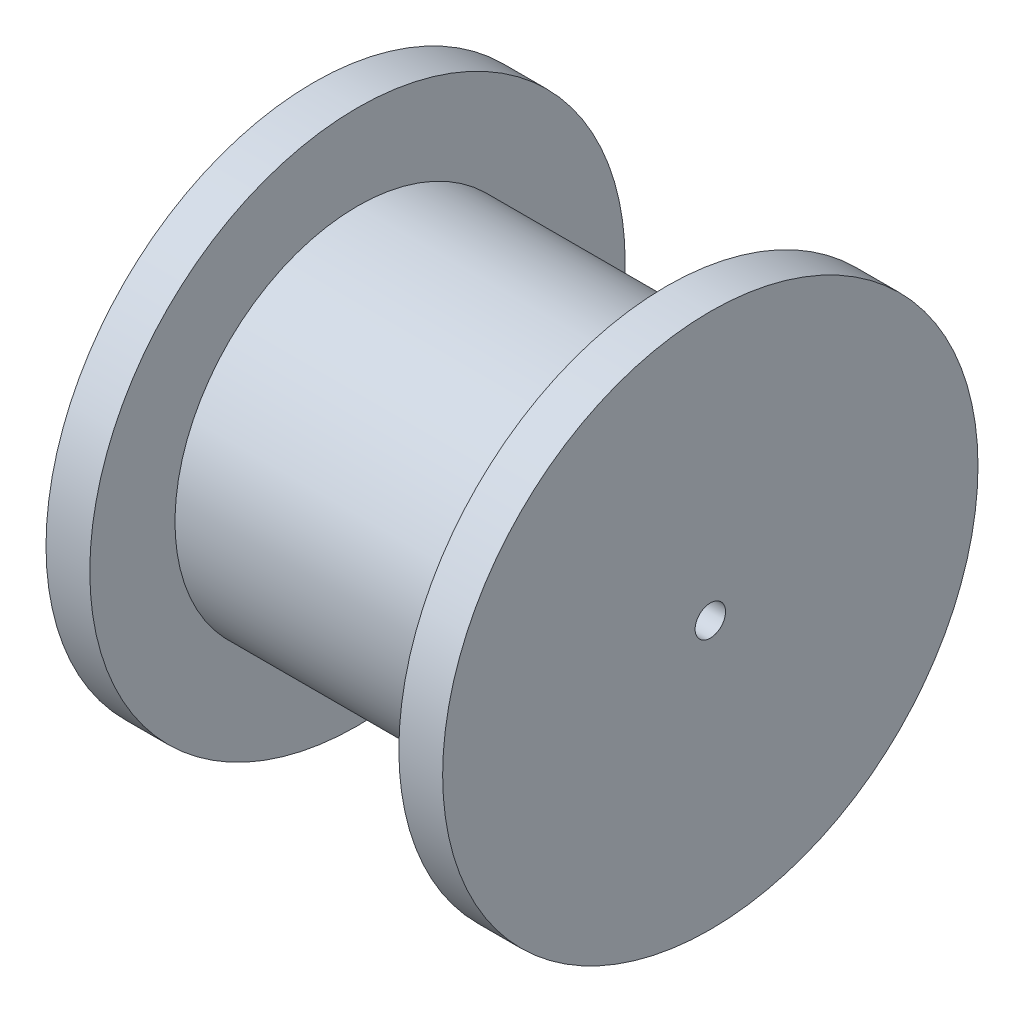
ISO-10303-21;
HEADER;
FILE_DESCRIPTION(('STEP AP214'),'2;1');
FILE_NAME('part.step','',(''),(''),'','','');
FILE_SCHEMA(('AUTOMOTIVE_DESIGN { 1 0 10303 214 1 1 1 1 }'));
ENDSEC;
DATA;
#1=APPLICATION_CONTEXT('core data for automotive mechanical design processes');
#2=APPLICATION_PROTOCOL_DEFINITION('international standard','automotive_design',2000,#1);
#3=PRODUCT_CONTEXT('',#1,'mechanical');
#4=PRODUCT('Part','Part','',(#3));
#5=PRODUCT_RELATED_PRODUCT_CATEGORY('part','',(#4));
#6=PRODUCT_DEFINITION_FORMATION('','',#4);
#7=PRODUCT_DEFINITION_CONTEXT('part definition',#1,'design');
#8=PRODUCT_DEFINITION('design','',#6,#7);
#9=PRODUCT_DEFINITION_SHAPE('','',#8);
#10=(LENGTH_UNIT() NAMED_UNIT(*) SI_UNIT(.MILLI.,.METRE.));
#11=(NAMED_UNIT(*) PLANE_ANGLE_UNIT() SI_UNIT($,.RADIAN.));
#12=(NAMED_UNIT(*) SI_UNIT($,.STERADIAN.) SOLID_ANGLE_UNIT());
#13=UNCERTAINTY_MEASURE_WITH_UNIT(LENGTH_MEASURE(1.E-05),#10,'distance_accuracy_value','');
#14=(GEOMETRIC_REPRESENTATION_CONTEXT(3) GLOBAL_UNCERTAINTY_ASSIGNED_CONTEXT((#13)) GLOBAL_UNIT_ASSIGNED_CONTEXT((#10,
#11,#12)) REPRESENTATION_CONTEXT('',''));
#15=CARTESIAN_POINT('',(0.,0.,0.));
#16=DIRECTION('',(0.,0.,1.));
#17=DIRECTION('',(1.,0.,0.));
#18=AXIS2_PLACEMENT_3D('',#15,#16,#17);
#19=CARTESIAN_POINT('',(-32.6,0.,0.));
#20=DIRECTION('',(1.,0.,0.));
#21=DIRECTION('',(0.,1.,0.));
#22=AXIS2_PLACEMENT_3D('',#19,#20,#21);
#23=PLANE('',#22);
#24=CARTESIAN_POINT('',(-32.6,0.,0.));
#25=DIRECTION('',(-1.,0.,0.));
#26=DIRECTION('',(0.,-1.,0.));
#27=AXIS2_PLACEMENT_3D('',#24,#25,#26);
#28=CIRCLE('',#27,1.25);
#29=CARTESIAN_POINT('',(-32.6,-1.25000000000001,0.));
#30=VERTEX_POINT('',#29);
#31=EDGE_CURVE('E71',#30,#30,#28,.T.);
#32=ORIENTED_EDGE('',*,*,#31,.F.);
#33=EDGE_LOOP('',(#32));
#34=FACE_BOUND('',#33,.T.);
#35=CARTESIAN_POINT('',(-32.6,0.,0.));
#36=DIRECTION('',(1.,0.,0.));
#37=DIRECTION('',(0.,1.,0.));
#38=AXIS2_PLACEMENT_3D('',#35,#36,#37);
#39=CIRCLE('',#38,22.);
#40=CARTESIAN_POINT('',(-32.6,22.,0.));
#41=VERTEX_POINT('',#40);
#42=EDGE_CURVE('E66',#41,#41,#39,.T.);
#43=ORIENTED_EDGE('',*,*,#42,.F.);
#44=EDGE_LOOP('',(#43));
#45=FACE_BOUND('',#44,.T.);
#46=ADVANCED_FACE('F39',(#34,#45),#23,.F.);
#47=CARTESIAN_POINT('',(0.,0.,0.));
#48=DIRECTION('',(1.,0.,0.));
#49=DIRECTION('',(0.,1.,0.));
#50=AXIS2_PLACEMENT_3D('',#47,#48,#49);
#51=PLANE('',#50);
#52=CARTESIAN_POINT('',(0.,0.,0.));
#53=DIRECTION('',(-1.,0.,0.));
#54=DIRECTION('',(0.,-1.,0.));
#55=AXIS2_PLACEMENT_3D('',#52,#53,#54);
#56=CIRCLE('',#55,1.25);
#57=CARTESIAN_POINT('',(0.,-1.25,0.));
#58=VERTEX_POINT('',#57);
#59=EDGE_CURVE('E70',#58,#58,#56,.T.);
#60=ORIENTED_EDGE('',*,*,#59,.T.);
#61=EDGE_LOOP('',(#60));
#62=FACE_BOUND('',#61,.T.);
#63=CARTESIAN_POINT('',(0.,0.,0.));
#64=DIRECTION('',(1.,0.,0.));
#65=DIRECTION('',(0.,1.,0.));
#66=AXIS2_PLACEMENT_3D('',#63,#64,#65);
#67=CIRCLE('',#66,22.);
#68=CARTESIAN_POINT('',(0.,22.,0.));
#69=VERTEX_POINT('',#68);
#70=EDGE_CURVE('E10',#69,#69,#67,.T.);
#71=ORIENTED_EDGE('',*,*,#70,.T.);
#72=EDGE_LOOP('',(#71));
#73=FACE_BOUND('',#72,.T.);
#74=ADVANCED_FACE('F79',(#62,#73),#51,.T.);
#75=CARTESIAN_POINT('',(0.,0.,0.));
#76=DIRECTION('',(1.,0.,0.));
#77=DIRECTION('',(0.,1.,0.));
#78=AXIS2_PLACEMENT_3D('',#75,#76,#77);
#79=CYLINDRICAL_SURFACE('',#78,22.);
#80=ORIENTED_EDGE('',*,*,#70,.F.);
#81=EDGE_LOOP('',(#80));
#82=FACE_BOUND('',#81,.T.);
#83=CARTESIAN_POINT('',(-3.59999999999999,0.,0.));
#84=DIRECTION('',(1.,0.,0.));
#85=DIRECTION('',(0.,1.,0.));
#86=AXIS2_PLACEMENT_3D('',#83,#84,#85);
#87=CIRCLE('',#86,22.);
#88=CARTESIAN_POINT('',(-3.6,22.,0.));
#89=VERTEX_POINT('',#88);
#90=EDGE_CURVE('E46',#89,#89,#87,.T.);
#91=ORIENTED_EDGE('',*,*,#90,.T.);
#92=EDGE_LOOP('',(#91));
#93=FACE_BOUND('',#92,.T.);
#94=ADVANCED_FACE('F110',(#82,#93),#79,.T.);
#95=CARTESIAN_POINT('',(-3.59999999999999,0.,0.));
#96=DIRECTION('',(-1.,0.,0.));
#97=DIRECTION('',(0.,-1.,0.));
#98=AXIS2_PLACEMENT_3D('',#95,#96,#97);
#99=PLANE('',#98);
#100=CARTESIAN_POINT('',(-3.6,0.,0.));
#101=DIRECTION('',(1.,0.,0.));
#102=DIRECTION('',(0.,1.,0.));
#103=AXIS2_PLACEMENT_3D('',#100,#101,#102);
#104=CIRCLE('',#103,15.);
#105=CARTESIAN_POINT('',(-3.6,15.,0.));
#106=VERTEX_POINT('',#105);
#107=EDGE_CURVE('E51',#106,#106,#104,.T.);
#108=ORIENTED_EDGE('',*,*,#107,.T.);
#109=EDGE_LOOP('',(#108));
#110=FACE_BOUND('',#109,.T.);
#111=ORIENTED_EDGE('',*,*,#90,.F.);
#112=EDGE_LOOP('',(#111));
#113=FACE_BOUND('',#112,.T.);
#114=ADVANCED_FACE('F106',(#110,#113),#99,.T.);
#115=CARTESIAN_POINT('',(0.,0.,0.));
#116=DIRECTION('',(1.,0.,0.));
#117=DIRECTION('',(0.,1.,0.));
#118=AXIS2_PLACEMENT_3D('',#115,#116,#117);
#119=CYLINDRICAL_SURFACE('',#118,15.);
#120=CARTESIAN_POINT('',(-29.,0.,0.));
#121=DIRECTION('',(1.,0.,0.));
#122=DIRECTION('',(0.,1.,0.));
#123=AXIS2_PLACEMENT_3D('',#120,#121,#122);
#124=CIRCLE('',#123,15.);
#125=CARTESIAN_POINT('',(-29.,15.,0.));
#126=VERTEX_POINT('',#125);
#127=EDGE_CURVE('E56',#126,#126,#124,.T.);
#128=ORIENTED_EDGE('',*,*,#127,.T.);
#129=EDGE_LOOP('',(#128));
#130=FACE_BOUND('',#129,.T.);
#131=ORIENTED_EDGE('',*,*,#107,.F.);
#132=EDGE_LOOP('',(#131));
#133=FACE_BOUND('',#132,.T.);
#134=ADVANCED_FACE('F99',(#130,#133),#119,.T.);
#135=CARTESIAN_POINT('',(-29.,0.,0.));
#136=DIRECTION('',(-1.,0.,0.));
#137=DIRECTION('',(0.,-1.,0.));
#138=AXIS2_PLACEMENT_3D('',#135,#136,#137);
#139=PLANE('',#138);
#140=ORIENTED_EDGE('',*,*,#127,.F.);
#141=EDGE_LOOP('',(#140));
#142=FACE_BOUND('',#141,.T.);
#143=CARTESIAN_POINT('',(-29.,0.,0.));
#144=DIRECTION('',(1.,0.,0.));
#145=DIRECTION('',(0.,1.,0.));
#146=AXIS2_PLACEMENT_3D('',#143,#144,#145);
#147=CIRCLE('',#146,22.);
#148=CARTESIAN_POINT('',(-29.,22.,0.));
#149=VERTEX_POINT('',#148);
#150=EDGE_CURVE('E62',#149,#149,#147,.T.);
#151=ORIENTED_EDGE('',*,*,#150,.T.);
#152=EDGE_LOOP('',(#151));
#153=FACE_BOUND('',#152,.T.);
#154=ADVANCED_FACE('F93',(#142,#153),#139,.F.);
#155=CARTESIAN_POINT('',(0.,0.,0.));
#156=DIRECTION('',(1.,0.,0.));
#157=DIRECTION('',(0.,1.,0.));
#158=AXIS2_PLACEMENT_3D('',#155,#156,#157);
#159=CYLINDRICAL_SURFACE('',#158,22.);
#160=ORIENTED_EDGE('',*,*,#150,.F.);
#161=EDGE_LOOP('',(#160));
#162=FACE_BOUND('',#161,.T.);
#163=ORIENTED_EDGE('',*,*,#42,.T.);
#164=EDGE_LOOP('',(#163));
#165=FACE_BOUND('',#164,.T.);
#166=ADVANCED_FACE('F84',(#162,#165),#159,.T.);
#167=CARTESIAN_POINT('',(0.,0.,0.));
#168=DIRECTION('',(-1.,0.,0.));
#169=DIRECTION('',(0.,-1.,0.));
#170=AXIS2_PLACEMENT_3D('',#167,#168,#169);
#171=CYLINDRICAL_SURFACE('',#170,1.25);
#172=ORIENTED_EDGE('',*,*,#59,.F.);
#173=EDGE_LOOP('',(#172));
#174=FACE_BOUND('',#173,.T.);
#175=ORIENTED_EDGE('',*,*,#31,.T.);
#176=EDGE_LOOP('',(#175));
#177=FACE_BOUND('',#176,.T.);
#178=ADVANCED_FACE('F81',(#174,#177),#171,.F.);
#179=CLOSED_SHELL('',(#46,#74,#94,#114,#134,#154,#166,#178));
#180=MANIFOLD_SOLID_BREP('B2',#179);
#181=ADVANCED_BREP_SHAPE_REPRESENTATION('',(#18,#180),#14);
#182=SHAPE_DEFINITION_REPRESENTATION(#9,#181);
ENDSEC;
END-ISO-10303-21;
